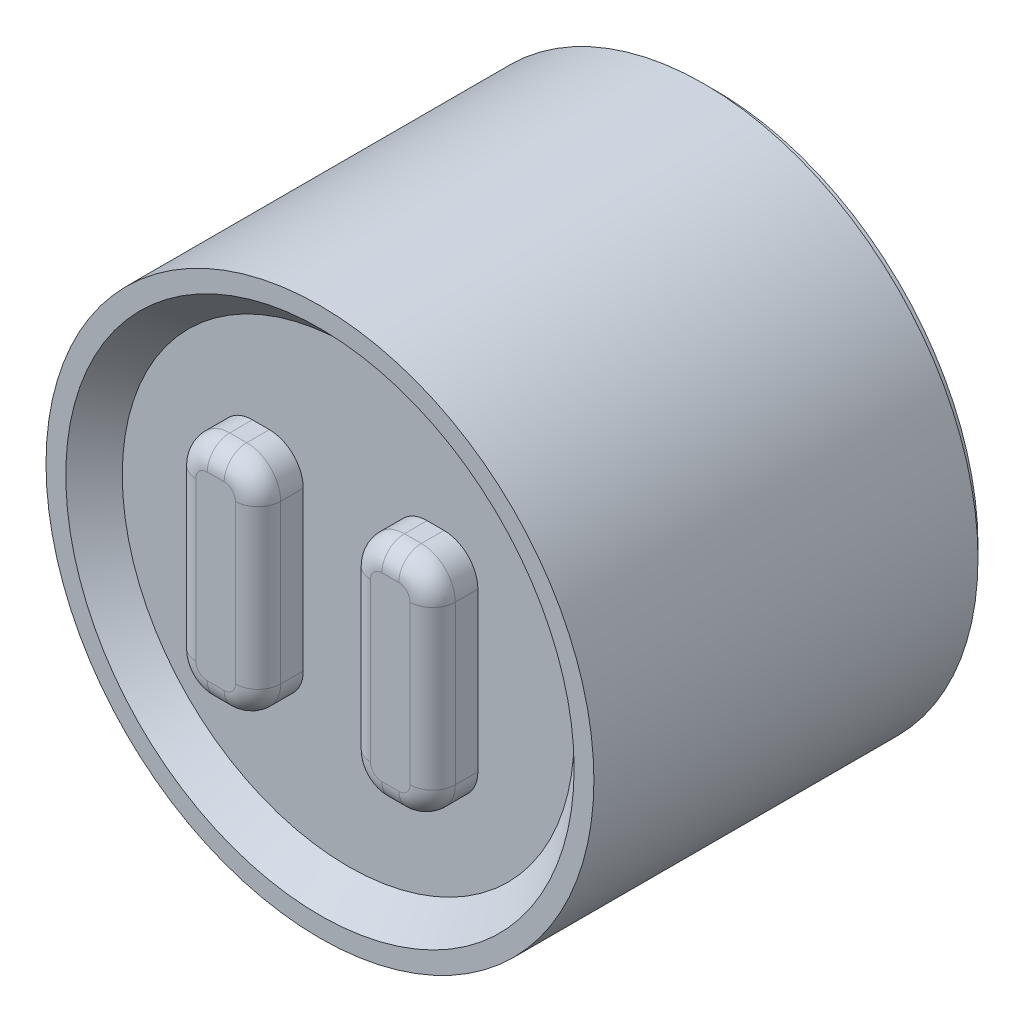
ISO-10303-21;
HEADER;
FILE_DESCRIPTION(('STEP AP214'),'2;1');
FILE_NAME('part.step','',(''),(''),'','','');
FILE_SCHEMA(('AUTOMOTIVE_DESIGN { 1 0 10303 214 1 1 1 1 }'));
ENDSEC;
DATA;
#1=APPLICATION_CONTEXT('core data for automotive mechanical design processes');
#2=APPLICATION_PROTOCOL_DEFINITION('international standard','automotive_design',2000,#1);
#3=PRODUCT_CONTEXT('',#1,'mechanical');
#4=PRODUCT('Part','Part','',(#3));
#5=PRODUCT_RELATED_PRODUCT_CATEGORY('part','',(#4));
#6=PRODUCT_DEFINITION_FORMATION('','',#4);
#7=PRODUCT_DEFINITION_CONTEXT('part definition',#1,'design');
#8=PRODUCT_DEFINITION('design','',#6,#7);
#9=PRODUCT_DEFINITION_SHAPE('','',#8);
#10=(LENGTH_UNIT() NAMED_UNIT(*) SI_UNIT(.MILLI.,.METRE.));
#11=(NAMED_UNIT(*) PLANE_ANGLE_UNIT() SI_UNIT($,.RADIAN.));
#12=(NAMED_UNIT(*) SI_UNIT($,.STERADIAN.) SOLID_ANGLE_UNIT());
#13=UNCERTAINTY_MEASURE_WITH_UNIT(LENGTH_MEASURE(1.E-05),#10,'distance_accuracy_value','');
#14=(GEOMETRIC_REPRESENTATION_CONTEXT(3) GLOBAL_UNCERTAINTY_ASSIGNED_CONTEXT((#13)) GLOBAL_UNIT_ASSIGNED_CONTEXT((#10,
#11,#12)) REPRESENTATION_CONTEXT('',''));
#15=CARTESIAN_POINT('',(0.,0.,0.));
#16=DIRECTION('',(0.,0.,1.));
#17=DIRECTION('',(1.,0.,0.));
#18=AXIS2_PLACEMENT_3D('',#15,#16,#17);
#19=CARTESIAN_POINT('',(0.,0.,6.3));
#20=DIRECTION('',(0.,0.,1.));
#21=DIRECTION('',(1.,0.,0.));
#22=AXIS2_PLACEMENT_3D('',#19,#20,#21);
#23=PLANE('',#22);
#24=CARTESIAN_POINT('',(0.,0.,6.3));
#25=DIRECTION('',(0.,0.,1.));
#26=DIRECTION('',(1.,0.,0.));
#27=AXIS2_PLACEMENT_3D('',#24,#25,#26);
#28=CIRCLE('',#27,4.);
#29=CARTESIAN_POINT('',(4.,0.,6.3));
#30=VERTEX_POINT('',#29);
#31=EDGE_CURVE('E294',#30,#30,#28,.T.);
#32=ORIENTED_EDGE('',*,*,#31,.T.);
#33=EDGE_LOOP('',(#32));
#34=FACE_BOUND('',#33,.T.);
#35=DIRECTION('',(1.,0.,0.));
#36=VECTOR('',#35,1.);
#37=CARTESIAN_POINT('',(-1.69576329592916,-2.,6.3));
#38=LINE('',#37,#36);
#39=CARTESIAN_POINT('',(-1.69576329592916,-2.,6.3));
#40=VERTEX_POINT('',#39);
#41=CARTESIAN_POINT('',(-1.39576329592917,-2.,6.3));
#42=VERTEX_POINT('',#41);
#43=EDGE_CURVE('E257',#40,#42,#38,.T.);
#44=ORIENTED_EDGE('',*,*,#43,.F.);
#45=CARTESIAN_POINT('',(-1.69576329592916,-1.4,6.3));
#46=DIRECTION('',(0.,0.,1.));
#47=DIRECTION('',(1.,0.,0.));
#48=AXIS2_PLACEMENT_3D('',#45,#46,#47);
#49=CIRCLE('',#48,0.6);
#50=CARTESIAN_POINT('',(-2.29576329592916,-1.4,6.3));
#51=VERTEX_POINT('',#50);
#52=EDGE_CURVE('E209',#51,#40,#49,.T.);
#53=ORIENTED_EDGE('',*,*,#52,.F.);
#54=DIRECTION('',(0.,-1.,0.));
#55=VECTOR('',#54,1.);
#56=CARTESIAN_POINT('',(-2.29576329592916,1.4,6.3));
#57=LINE('',#56,#55);
#58=CARTESIAN_POINT('',(-2.29576329592916,1.4,6.3));
#59=VERTEX_POINT('',#58);
#60=EDGE_CURVE('E275',#59,#51,#57,.T.);
#61=ORIENTED_EDGE('',*,*,#60,.F.);
#62=CARTESIAN_POINT('',(-1.69576329592916,1.4,6.3));
#63=DIRECTION('',(0.,0.,1.));
#64=DIRECTION('',(1.,0.,0.));
#65=AXIS2_PLACEMENT_3D('',#62,#63,#64);
#66=CIRCLE('',#65,0.6);
#67=CARTESIAN_POINT('',(-1.69576329592916,2.,6.3));
#68=VERTEX_POINT('',#67);
#69=EDGE_CURVE('E272',#68,#59,#66,.T.);
#70=ORIENTED_EDGE('',*,*,#69,.F.);
#71=DIRECTION('',(-1.,0.,0.));
#72=VECTOR('',#71,1.);
#73=CARTESIAN_POINT('',(-1.69576329592916,2.,6.3));
#74=LINE('',#73,#72);
#75=CARTESIAN_POINT('',(-1.39576329592917,2.,6.3));
#76=VERTEX_POINT('',#75);
#77=EDGE_CURVE('E269',#76,#68,#74,.T.);
#78=ORIENTED_EDGE('',*,*,#77,.F.);
#79=CARTESIAN_POINT('',(-1.39576329592916,1.4,6.3));
#80=DIRECTION('',(0.,0.,1.));
#81=DIRECTION('',(-1.,0.,0.));
#82=AXIS2_PLACEMENT_3D('',#79,#80,#81);
#83=CIRCLE('',#82,0.6);
#84=CARTESIAN_POINT('',(-0.795763295929162,1.4,6.3));
#85=VERTEX_POINT('',#84);
#86=EDGE_CURVE('E266',#85,#76,#83,.T.);
#87=ORIENTED_EDGE('',*,*,#86,.F.);
#88=DIRECTION('',(0.,1.,0.));
#89=VECTOR('',#88,1.);
#90=CARTESIAN_POINT('',(-0.795763295929162,1.4,6.3));
#91=LINE('',#90,#89);
#92=CARTESIAN_POINT('',(-0.795763295929162,-1.4,6.3));
#93=VERTEX_POINT('',#92);
#94=EDGE_CURVE('E263',#93,#85,#91,.T.);
#95=ORIENTED_EDGE('',*,*,#94,.F.);
#96=CARTESIAN_POINT('',(-1.39576329592916,-1.4,6.3));
#97=DIRECTION('',(0.,0.,1.));
#98=DIRECTION('',(1.,0.,0.));
#99=AXIS2_PLACEMENT_3D('',#96,#97,#98);
#100=CIRCLE('',#99,0.6);
#101=EDGE_CURVE('E260',#42,#93,#100,.T.);
#102=ORIENTED_EDGE('',*,*,#101,.F.);
#103=EDGE_LOOP('',(#44,#53,#61,#70,#78,#87,#95,#102));
#104=FACE_BOUND('',#103,.T.);
#105=DIRECTION('',(-1.,0.,0.));
#106=VECTOR('',#105,1.);
#107=CARTESIAN_POINT('',(1.69576329592916,2.,6.3));
#108=LINE('',#107,#106);
#109=CARTESIAN_POINT('',(1.69576329592916,2.,6.3));
#110=VERTEX_POINT('',#109);
#111=CARTESIAN_POINT('',(1.39576329592917,2.,6.3));
#112=VERTEX_POINT('',#111);
#113=EDGE_CURVE('E203',#110,#112,#108,.T.);
#114=ORIENTED_EDGE('',*,*,#113,.F.);
#115=CARTESIAN_POINT('',(1.69576329592916,1.4,6.3));
#116=DIRECTION('',(0.,0.,1.));
#117=DIRECTION('',(-1.,0.,0.));
#118=AXIS2_PLACEMENT_3D('',#115,#116,#117);
#119=CIRCLE('',#118,0.6);
#120=CARTESIAN_POINT('',(2.29576329592916,1.4,6.3));
#121=VERTEX_POINT('',#120);
#122=EDGE_CURVE('E213',#121,#110,#119,.T.);
#123=ORIENTED_EDGE('',*,*,#122,.F.);
#124=DIRECTION('',(0.,1.,0.));
#125=VECTOR('',#124,1.);
#126=CARTESIAN_POINT('',(2.29576329592916,1.4,6.3));
#127=LINE('',#126,#125);
#128=CARTESIAN_POINT('',(2.29576329592916,-1.4,6.3));
#129=VERTEX_POINT('',#128);
#130=EDGE_CURVE('E241',#129,#121,#127,.T.);
#131=ORIENTED_EDGE('',*,*,#130,.F.);
#132=CARTESIAN_POINT('',(1.69576329592916,-1.4,6.3));
#133=DIRECTION('',(0.,0.,1.));
#134=DIRECTION('',(-1.,0.,0.));
#135=AXIS2_PLACEMENT_3D('',#132,#133,#134);
#136=CIRCLE('',#135,0.6);
#137=CARTESIAN_POINT('',(1.69576329592916,-2.,6.3));
#138=VERTEX_POINT('',#137);
#139=EDGE_CURVE('E238',#138,#129,#136,.T.);
#140=ORIENTED_EDGE('',*,*,#139,.F.);
#141=DIRECTION('',(1.,0.,0.));
#142=VECTOR('',#141,1.);
#143=CARTESIAN_POINT('',(1.69576329592916,-2.,6.3));
#144=LINE('',#143,#142);
#145=CARTESIAN_POINT('',(1.39576329592917,-2.,6.3));
#146=VERTEX_POINT('',#145);
#147=EDGE_CURVE('E235',#146,#138,#144,.T.);
#148=ORIENTED_EDGE('',*,*,#147,.F.);
#149=CARTESIAN_POINT('',(1.39576329592916,-1.4,6.3));
#150=DIRECTION('',(0.,0.,1.));
#151=DIRECTION('',(-1.,0.,0.));
#152=AXIS2_PLACEMENT_3D('',#149,#150,#151);
#153=CIRCLE('',#152,0.6);
#154=CARTESIAN_POINT('',(0.795763295929162,-1.4,6.3));
#155=VERTEX_POINT('',#154);
#156=EDGE_CURVE('E232',#155,#146,#153,.T.);
#157=ORIENTED_EDGE('',*,*,#156,.F.);
#158=DIRECTION('',(0.,-1.,0.));
#159=VECTOR('',#158,1.);
#160=CARTESIAN_POINT('',(0.795763295929162,1.4,6.3));
#161=LINE('',#160,#159);
#162=CARTESIAN_POINT('',(0.795763295929162,1.4,6.3));
#163=VERTEX_POINT('',#162);
#164=EDGE_CURVE('E226',#163,#155,#161,.T.);
#165=ORIENTED_EDGE('',*,*,#164,.F.);
#166=CARTESIAN_POINT('',(1.39576329592916,1.4,6.3));
#167=DIRECTION('',(0.,0.,1.));
#168=DIRECTION('',(1.,0.,0.));
#169=AXIS2_PLACEMENT_3D('',#166,#167,#168);
#170=CIRCLE('',#169,0.6);
#171=EDGE_CURVE('E224',#112,#163,#170,.T.);
#172=ORIENTED_EDGE('',*,*,#171,.F.);
#173=EDGE_LOOP('',(#114,#123,#131,#140,#148,#157,#165,#172));
#174=FACE_BOUND('',#173,.T.);
#175=ADVANCED_FACE('F36',(#34,#104,#174),#23,.T.);
#176=CARTESIAN_POINT('',(0.,0.,6.8));
#177=DIRECTION('',(0.,0.,-1.));
#178=DIRECTION('',(-1.,0.,0.));
#179=AXIS2_PLACEMENT_3D('',#176,#177,#178);
#180=CYLINDRICAL_SURFACE('',#179,4.85);
#181=CARTESIAN_POINT('',(0.,0.,6.8));
#182=DIRECTION('',(0.,0.,1.));
#183=DIRECTION('',(1.,0.,0.));
#184=AXIS2_PLACEMENT_3D('',#181,#182,#183);
#185=CIRCLE('',#184,4.85);
#186=CARTESIAN_POINT('',(4.85,0.,6.8));
#187=VERTEX_POINT('',#186);
#188=EDGE_CURVE('E298',#187,#187,#185,.T.);
#189=ORIENTED_EDGE('',*,*,#188,.F.);
#190=EDGE_LOOP('',(#189));
#191=FACE_BOUND('',#190,.T.);
#192=CARTESIAN_POINT('',(0.,0.,0.));
#193=DIRECTION('',(0.,0.,1.));
#194=DIRECTION('',(1.,0.,0.));
#195=AXIS2_PLACEMENT_3D('',#192,#193,#194);
#196=CIRCLE('',#195,4.85);
#197=CARTESIAN_POINT('',(4.85,0.,0.));
#198=VERTEX_POINT('',#197);
#199=EDGE_CURVE('E297',#198,#198,#196,.T.);
#200=ORIENTED_EDGE('',*,*,#199,.T.);
#201=EDGE_LOOP('',(#200));
#202=FACE_BOUND('',#201,.T.);
#203=ADVANCED_FACE('F489',(#191,#202),#180,.T.);
#204=CARTESIAN_POINT('',(0.,0.,6.8));
#205=DIRECTION('',(0.,0.,1.));
#206=DIRECTION('',(1.,0.,0.));
#207=AXIS2_PLACEMENT_3D('',#204,#205,#206);
#208=PLANE('',#207);
#209=CARTESIAN_POINT('',(0.,0.,6.8));
#210=DIRECTION('',(0.,0.,1.));
#211=DIRECTION('',(1.,0.,0.));
#212=AXIS2_PLACEMENT_3D('',#209,#210,#211);
#213=CIRCLE('',#212,4.50000000000001);
#214=CARTESIAN_POINT('',(4.50000000000001,0.,6.8));
#215=VERTEX_POINT('',#214);
#216=EDGE_CURVE('E301',#215,#215,#213,.F.);
#217=ORIENTED_EDGE('',*,*,#216,.T.);
#218=EDGE_LOOP('',(#217));
#219=FACE_BOUND('',#218,.T.);
#220=ORIENTED_EDGE('',*,*,#188,.T.);
#221=EDGE_LOOP('',(#220));
#222=FACE_BOUND('',#221,.T.);
#223=ADVANCED_FACE('F495',(#219,#222),#208,.T.);
#224=CARTESIAN_POINT('',(0.,0.,0.));
#225=DIRECTION('',(0.,0.,1.));
#226=DIRECTION('',(1.,0.,0.));
#227=AXIS2_PLACEMENT_3D('',#224,#225,#226);
#228=PLANE('',#227);
#229=CARTESIAN_POINT('',(0.,0.,0.));
#230=DIRECTION('',(0.,0.,1.));
#231=DIRECTION('',(1.,0.,0.));
#232=AXIS2_PLACEMENT_3D('',#229,#230,#231);
#233=CIRCLE('',#232,4.65);
#234=CARTESIAN_POINT('',(4.65,0.,0.));
#235=VERTEX_POINT('',#234);
#236=EDGE_CURVE('E11',#235,#235,#233,.F.);
#237=ORIENTED_EDGE('',*,*,#236,.F.);
#238=EDGE_LOOP('',(#237));
#239=FACE_BOUND('',#238,.T.);
#240=ORIENTED_EDGE('',*,*,#199,.F.);
#241=EDGE_LOOP('',(#240));
#242=FACE_BOUND('',#241,.T.);
#243=ADVANCED_FACE('F503',(#239,#242),#228,.F.);
#244=CARTESIAN_POINT('',(0.,0.,6.3));
#245=DIRECTION('',(0.,0.,1.));
#246=DIRECTION('',(1.,0.,0.));
#247=AXIS2_PLACEMENT_3D('',#244,#245,#246);
#248=CONICAL_SURFACE('',#247,4.,0.78539816339745);
#249=ORIENTED_EDGE('',*,*,#216,.F.);
#250=EDGE_LOOP('',(#249));
#251=FACE_BOUND('',#250,.T.);
#252=ORIENTED_EDGE('',*,*,#31,.F.);
#253=EDGE_LOOP('',(#252));
#254=FACE_BOUND('',#253,.T.);
#255=ADVANCED_FACE('F506',(#251,#254),#248,.F.);
#256=CARTESIAN_POINT('',(-1.69576329592916,-1.4,7.1));
#257=DIRECTION('',(0.,0.,-1.));
#258=DIRECTION('',(-1.,0.,0.));
#259=AXIS2_PLACEMENT_3D('',#256,#257,#258);
#260=CYLINDRICAL_SURFACE('',#259,0.6);
#261=DIRECTION('',(0.,0.,-1.));
#262=VECTOR('',#261,1.);
#263=CARTESIAN_POINT('',(-1.69576329592916,-2.,7.1));
#264=LINE('',#263,#262);
#265=CARTESIAN_POINT('',(-1.69576329592916,-2.,6.7));
#266=VERTEX_POINT('',#265);
#267=EDGE_CURVE('E292',#266,#40,#264,.T.);
#268=ORIENTED_EDGE('',*,*,#267,.F.);
#269=CARTESIAN_POINT('',(-1.69576329592916,-1.4,6.7));
#270=DIRECTION('',(0.,0.,1.));
#271=DIRECTION('',(1.,0.,0.));
#272=AXIS2_PLACEMENT_3D('',#269,#270,#271);
#273=CIRCLE('',#272,0.6);
#274=CARTESIAN_POINT('',(-2.29576329592916,-1.4,6.7));
#275=VERTEX_POINT('',#274);
#276=EDGE_CURVE('E361',#266,#275,#273,.F.);
#277=ORIENTED_EDGE('',*,*,#276,.T.);
#278=DIRECTION('',(0.,0.,-1.));
#279=VECTOR('',#278,1.);
#280=CARTESIAN_POINT('',(-2.29576329592916,-1.4,7.1));
#281=LINE('',#280,#279);
#282=EDGE_CURVE('E278',#275,#51,#281,.T.);
#283=ORIENTED_EDGE('',*,*,#282,.T.);
#284=ORIENTED_EDGE('',*,*,#52,.T.);
#285=EDGE_LOOP('',(#268,#277,#283,#284));
#286=FACE_BOUND('',#285,.T.);
#287=ADVANCED_FACE('F435',(#286),#260,.T.);
#288=CARTESIAN_POINT('',(-1.69576329592916,-2.,7.1));
#289=DIRECTION('',(0.,1.,0.));
#290=DIRECTION('',(0.,0.,1.));
#291=AXIS2_PLACEMENT_3D('',#288,#289,#290);
#292=PLANE('',#291);
#293=DIRECTION('',(0.,0.,-1.));
#294=VECTOR('',#293,1.);
#295=CARTESIAN_POINT('',(-1.39576329592917,-2.,7.1));
#296=LINE('',#295,#294);
#297=CARTESIAN_POINT('',(-1.39576329592917,-2.,6.7));
#298=VERTEX_POINT('',#297);
#299=EDGE_CURVE('E290',#298,#42,#296,.T.);
#300=ORIENTED_EDGE('',*,*,#299,.F.);
#301=DIRECTION('',(1.,0.,0.));
#302=VECTOR('',#301,1.);
#303=CARTESIAN_POINT('',(-1.69576329592916,-2.,6.7));
#304=LINE('',#303,#302);
#305=EDGE_CURVE('E359',#298,#266,#304,.F.);
#306=ORIENTED_EDGE('',*,*,#305,.T.);
#307=ORIENTED_EDGE('',*,*,#267,.T.);
#308=ORIENTED_EDGE('',*,*,#43,.T.);
#309=EDGE_LOOP('',(#300,#306,#307,#308));
#310=FACE_BOUND('',#309,.T.);
#311=ADVANCED_FACE('F438',(#310),#292,.F.);
#312=CARTESIAN_POINT('',(-1.39576329592916,-1.4,7.1));
#313=DIRECTION('',(0.,0.,-1.));
#314=DIRECTION('',(-1.,0.,0.));
#315=AXIS2_PLACEMENT_3D('',#312,#313,#314);
#316=CYLINDRICAL_SURFACE('',#315,0.6);
#317=DIRECTION('',(0.,0.,-1.));
#318=VECTOR('',#317,1.);
#319=CARTESIAN_POINT('',(-0.795763295929162,-1.4,7.1));
#320=LINE('',#319,#318);
#321=CARTESIAN_POINT('',(-0.795763295929162,-1.4,6.7));
#322=VERTEX_POINT('',#321);
#323=EDGE_CURVE('E288',#322,#93,#320,.T.);
#324=ORIENTED_EDGE('',*,*,#323,.F.);
#325=CARTESIAN_POINT('',(-1.39576329592916,-1.4,6.7));
#326=DIRECTION('',(0.,0.,1.));
#327=DIRECTION('',(1.,0.,0.));
#328=AXIS2_PLACEMENT_3D('',#325,#326,#327);
#329=CIRCLE('',#328,0.6);
#330=EDGE_CURVE('E357',#322,#298,#329,.F.);
#331=ORIENTED_EDGE('',*,*,#330,.T.);
#332=ORIENTED_EDGE('',*,*,#299,.T.);
#333=ORIENTED_EDGE('',*,*,#101,.T.);
#334=EDGE_LOOP('',(#324,#331,#332,#333));
#335=FACE_BOUND('',#334,.T.);
#336=ADVANCED_FACE('F621',(#335),#316,.T.);
#337=CARTESIAN_POINT('',(-0.795763295929162,1.4,7.1));
#338=DIRECTION('',(-1.,0.,0.));
#339=DIRECTION('',(0.,-1.,0.));
#340=AXIS2_PLACEMENT_3D('',#337,#338,#339);
#341=PLANE('',#340);
#342=DIRECTION('',(0.,0.,-1.));
#343=VECTOR('',#342,1.);
#344=CARTESIAN_POINT('',(-0.795763295929162,1.4,7.1));
#345=LINE('',#344,#343);
#346=CARTESIAN_POINT('',(-0.795763295929162,1.4,6.7));
#347=VERTEX_POINT('',#346);
#348=EDGE_CURVE('E286',#347,#85,#345,.T.);
#349=ORIENTED_EDGE('',*,*,#348,.F.);
#350=DIRECTION('',(0.,1.,0.));
#351=VECTOR('',#350,1.);
#352=CARTESIAN_POINT('',(-0.795763295929162,-1.4,6.7));
#353=LINE('',#352,#351);
#354=EDGE_CURVE('E354',#347,#322,#353,.F.);
#355=ORIENTED_EDGE('',*,*,#354,.T.);
#356=ORIENTED_EDGE('',*,*,#323,.T.);
#357=ORIENTED_EDGE('',*,*,#94,.T.);
#358=EDGE_LOOP('',(#349,#355,#356,#357));
#359=FACE_BOUND('',#358,.T.);
#360=ADVANCED_FACE('F470',(#359),#341,.F.);
#361=CARTESIAN_POINT('',(-1.39576329592916,1.4,7.1));
#362=DIRECTION('',(0.,0.,-1.));
#363=DIRECTION('',(-1.,0.,0.));
#364=AXIS2_PLACEMENT_3D('',#361,#362,#363);
#365=CYLINDRICAL_SURFACE('',#364,0.6);
#366=DIRECTION('',(0.,0.,-1.));
#367=VECTOR('',#366,1.);
#368=CARTESIAN_POINT('',(-1.39576329592917,2.,7.1));
#369=LINE('',#368,#367);
#370=CARTESIAN_POINT('',(-1.39576329592917,2.,6.7));
#371=VERTEX_POINT('',#370);
#372=EDGE_CURVE('E284',#371,#76,#369,.T.);
#373=ORIENTED_EDGE('',*,*,#372,.F.);
#374=CARTESIAN_POINT('',(-1.39576329592916,1.4,6.7));
#375=DIRECTION('',(0.,0.,1.));
#376=DIRECTION('',(1.,0.,0.));
#377=AXIS2_PLACEMENT_3D('',#374,#375,#376);
#378=CIRCLE('',#377,0.6);
#379=EDGE_CURVE('E44',#371,#347,#378,.F.);
#380=ORIENTED_EDGE('',*,*,#379,.T.);
#381=ORIENTED_EDGE('',*,*,#348,.T.);
#382=ORIENTED_EDGE('',*,*,#86,.T.);
#383=EDGE_LOOP('',(#373,#380,#381,#382));
#384=FACE_BOUND('',#383,.T.);
#385=ADVANCED_FACE('F467',(#384),#365,.T.);
#386=CARTESIAN_POINT('',(-1.69576329592916,2.,7.1));
#387=DIRECTION('',(0.,-1.,0.));
#388=DIRECTION('',(0.,0.,-1.));
#389=AXIS2_PLACEMENT_3D('',#386,#387,#388);
#390=PLANE('',#389);
#391=DIRECTION('',(0.,0.,-1.));
#392=VECTOR('',#391,1.);
#393=CARTESIAN_POINT('',(-1.69576329592916,2.,7.1));
#394=LINE('',#393,#392);
#395=CARTESIAN_POINT('',(-1.69576329592916,2.,6.7));
#396=VERTEX_POINT('',#395);
#397=EDGE_CURVE('E282',#396,#68,#394,.T.);
#398=ORIENTED_EDGE('',*,*,#397,.F.);
#399=DIRECTION('',(-1.,0.,0.));
#400=VECTOR('',#399,1.);
#401=CARTESIAN_POINT('',(-1.39576329592917,2.,6.7));
#402=LINE('',#401,#400);
#403=EDGE_CURVE('E51',#396,#371,#402,.F.);
#404=ORIENTED_EDGE('',*,*,#403,.T.);
#405=ORIENTED_EDGE('',*,*,#372,.T.);
#406=ORIENTED_EDGE('',*,*,#77,.T.);
#407=EDGE_LOOP('',(#398,#404,#405,#406));
#408=FACE_BOUND('',#407,.T.);
#409=ADVANCED_FACE('F614',(#408),#390,.F.);
#410=CARTESIAN_POINT('',(-1.69576329592916,1.4,7.1));
#411=DIRECTION('',(0.,0.,-1.));
#412=DIRECTION('',(-1.,0.,0.));
#413=AXIS2_PLACEMENT_3D('',#410,#411,#412);
#414=CYLINDRICAL_SURFACE('',#413,0.6);
#415=DIRECTION('',(0.,0.,-1.));
#416=VECTOR('',#415,1.);
#417=CARTESIAN_POINT('',(-2.29576329592916,1.4,7.1));
#418=LINE('',#417,#416);
#419=CARTESIAN_POINT('',(-2.29576329592916,1.4,6.7));
#420=VERTEX_POINT('',#419);
#421=EDGE_CURVE('E280',#420,#59,#418,.T.);
#422=ORIENTED_EDGE('',*,*,#421,.F.);
#423=CARTESIAN_POINT('',(-1.69576329592916,1.4,6.7));
#424=DIRECTION('',(0.,0.,1.));
#425=DIRECTION('',(1.,0.,0.));
#426=AXIS2_PLACEMENT_3D('',#423,#424,#425);
#427=CIRCLE('',#426,0.6);
#428=EDGE_CURVE('E59',#420,#396,#427,.F.);
#429=ORIENTED_EDGE('',*,*,#428,.T.);
#430=ORIENTED_EDGE('',*,*,#397,.T.);
#431=ORIENTED_EDGE('',*,*,#69,.T.);
#432=EDGE_LOOP('',(#422,#429,#430,#431));
#433=FACE_BOUND('',#432,.T.);
#434=ADVANCED_FACE('F425',(#433),#414,.T.);
#435=CARTESIAN_POINT('',(-2.29576329592916,1.4,7.1));
#436=DIRECTION('',(1.,0.,0.));
#437=DIRECTION('',(0.,0.,-1.));
#438=AXIS2_PLACEMENT_3D('',#435,#436,#437);
#439=PLANE('',#438);
#440=ORIENTED_EDGE('',*,*,#282,.F.);
#441=DIRECTION('',(0.,-1.,0.));
#442=VECTOR('',#441,1.);
#443=CARTESIAN_POINT('',(-2.29576329592916,1.4,6.7));
#444=LINE('',#443,#442);
#445=EDGE_CURVE('E363',#275,#420,#444,.F.);
#446=ORIENTED_EDGE('',*,*,#445,.T.);
#447=ORIENTED_EDGE('',*,*,#421,.T.);
#448=ORIENTED_EDGE('',*,*,#60,.T.);
#449=EDGE_LOOP('',(#440,#446,#447,#448));
#450=FACE_BOUND('',#449,.T.);
#451=ADVANCED_FACE('F424',(#450),#439,.F.);
#452=CARTESIAN_POINT('',(-1.69576329592916,-1.4,7.1));
#453=DIRECTION('',(0.,0.,1.));
#454=DIRECTION('',(1.,0.,0.));
#455=AXIS2_PLACEMENT_3D('',#452,#453,#454);
#456=PLANE('',#455);
#457=CARTESIAN_POINT('',(-1.39576329592916,-1.4,7.1));
#458=DIRECTION('',(0.,0.,1.));
#459=DIRECTION('',(1.,0.,0.));
#460=AXIS2_PLACEMENT_3D('',#457,#458,#459);
#461=CIRCLE('',#460,0.2);
#462=CARTESIAN_POINT('',(-1.39576329592916,-1.6,7.1));
#463=VERTEX_POINT('',#462);
#464=CARTESIAN_POINT('',(-1.19576329592916,-1.4,7.1));
#465=VERTEX_POINT('',#464);
#466=EDGE_CURVE('E349',#463,#465,#461,.T.);
#467=ORIENTED_EDGE('',*,*,#466,.T.);
#468=DIRECTION('',(0.,1.,0.));
#469=VECTOR('',#468,1.);
#470=CARTESIAN_POINT('',(-1.19576329592916,1.4,7.1));
#471=LINE('',#470,#469);
#472=CARTESIAN_POINT('',(-1.19576329592916,1.4,7.1));
#473=VERTEX_POINT('',#472);
#474=EDGE_CURVE('E351',#465,#473,#471,.T.);
#475=ORIENTED_EDGE('',*,*,#474,.T.);
#476=CARTESIAN_POINT('',(-1.39576329592916,1.4,7.1));
#477=DIRECTION('',(0.,0.,1.));
#478=DIRECTION('',(1.,0.,0.));
#479=AXIS2_PLACEMENT_3D('',#476,#477,#478);
#480=CIRCLE('',#479,0.2);
#481=CARTESIAN_POINT('',(-1.39576329592917,1.6,7.1));
#482=VERTEX_POINT('',#481);
#483=EDGE_CURVE('E337',#473,#482,#480,.T.);
#484=ORIENTED_EDGE('',*,*,#483,.T.);
#485=DIRECTION('',(-1.,0.,0.));
#486=VECTOR('',#485,1.);
#487=CARTESIAN_POINT('',(-1.69576329592916,1.6,7.1));
#488=LINE('',#487,#486);
#489=CARTESIAN_POINT('',(-1.69576329592916,1.6,7.1));
#490=VERTEX_POINT('',#489);
#491=EDGE_CURVE('E339',#482,#490,#488,.T.);
#492=ORIENTED_EDGE('',*,*,#491,.T.);
#493=CARTESIAN_POINT('',(-1.69576329592916,1.4,7.1));
#494=DIRECTION('',(0.,0.,1.));
#495=DIRECTION('',(1.,0.,0.));
#496=AXIS2_PLACEMENT_3D('',#493,#494,#495);
#497=CIRCLE('',#496,0.2);
#498=CARTESIAN_POINT('',(-1.89576329592916,1.4,7.1));
#499=VERTEX_POINT('',#498);
#500=EDGE_CURVE('E341',#490,#499,#497,.T.);
#501=ORIENTED_EDGE('',*,*,#500,.T.);
#502=DIRECTION('',(0.,-1.,0.));
#503=VECTOR('',#502,1.);
#504=CARTESIAN_POINT('',(-1.89576329592916,-1.4,7.1));
#505=LINE('',#504,#503);
#506=CARTESIAN_POINT('',(-1.89576329592916,-1.4,7.1));
#507=VERTEX_POINT('',#506);
#508=EDGE_CURVE('E343',#499,#507,#505,.T.);
#509=ORIENTED_EDGE('',*,*,#508,.T.);
#510=CARTESIAN_POINT('',(-1.69576329592916,-1.4,7.1));
#511=DIRECTION('',(0.,0.,1.));
#512=DIRECTION('',(1.,0.,0.));
#513=AXIS2_PLACEMENT_3D('',#510,#511,#512);
#514=CIRCLE('',#513,0.2);
#515=CARTESIAN_POINT('',(-1.69576329592916,-1.6,7.1));
#516=VERTEX_POINT('',#515);
#517=EDGE_CURVE('E345',#507,#516,#514,.T.);
#518=ORIENTED_EDGE('',*,*,#517,.T.);
#519=DIRECTION('',(1.,0.,0.));
#520=VECTOR('',#519,1.);
#521=CARTESIAN_POINT('',(-1.39576329592917,-1.6,7.1));
#522=LINE('',#521,#520);
#523=EDGE_CURVE('E347',#516,#463,#522,.T.);
#524=ORIENTED_EDGE('',*,*,#523,.T.);
#525=EDGE_LOOP('',(#467,#475,#484,#492,#501,#509,#518,#524));
#526=FACE_BOUND('',#525,.T.);
#527=ADVANCED_FACE('F451',(#526),#456,.T.);
#528=CARTESIAN_POINT('',(1.69576329592916,1.4,7.1));
#529=DIRECTION('',(0.,0.,-1.));
#530=DIRECTION('',(-1.,0.,0.));
#531=AXIS2_PLACEMENT_3D('',#528,#529,#530);
#532=CYLINDRICAL_SURFACE('',#531,0.6);
#533=DIRECTION('',(0.,0.,-1.));
#534=VECTOR('',#533,1.);
#535=CARTESIAN_POINT('',(1.69576329592916,2.,7.1));
#536=LINE('',#535,#534);
#537=CARTESIAN_POINT('',(1.69576329592916,2.,6.7));
#538=VERTEX_POINT('',#537);
#539=EDGE_CURVE('E198',#538,#110,#536,.T.);
#540=ORIENTED_EDGE('',*,*,#539,.F.);
#541=CARTESIAN_POINT('',(1.69576329592916,1.4,6.7));
#542=DIRECTION('',(0.,0.,-1.));
#543=DIRECTION('',(-1.,0.,0.));
#544=AXIS2_PLACEMENT_3D('',#541,#542,#543);
#545=CIRCLE('',#544,0.6);
#546=CARTESIAN_POINT('',(2.29576329592916,1.4,6.7));
#547=VERTEX_POINT('',#546);
#548=EDGE_CURVE('E367',#538,#547,#545,.T.);
#549=ORIENTED_EDGE('',*,*,#548,.T.);
#550=DIRECTION('',(0.,0.,-1.));
#551=VECTOR('',#550,1.);
#552=CARTESIAN_POINT('',(2.29576329592916,1.4,7.1));
#553=LINE('',#552,#551);
#554=EDGE_CURVE('E216',#547,#121,#553,.T.);
#555=ORIENTED_EDGE('',*,*,#554,.T.);
#556=ORIENTED_EDGE('',*,*,#122,.T.);
#557=EDGE_LOOP('',(#540,#549,#555,#556));
#558=FACE_BOUND('',#557,.T.);
#559=ADVANCED_FACE('F214',(#558),#532,.T.);
#560=CARTESIAN_POINT('',(1.69576329592916,2.,7.1));
#561=DIRECTION('',(0.,-1.,0.));
#562=DIRECTION('',(0.,0.,-1.));
#563=AXIS2_PLACEMENT_3D('',#560,#561,#562);
#564=PLANE('',#563);
#565=DIRECTION('',(0.,0.,-1.));
#566=VECTOR('',#565,1.);
#567=CARTESIAN_POINT('',(1.39576329592917,2.,7.1));
#568=LINE('',#567,#566);
#569=CARTESIAN_POINT('',(1.39576329592917,2.,6.7));
#570=VERTEX_POINT('',#569);
#571=EDGE_CURVE('E210',#570,#112,#568,.T.);
#572=ORIENTED_EDGE('',*,*,#571,.F.);
#573=DIRECTION('',(-1.,0.,0.));
#574=VECTOR('',#573,1.);
#575=CARTESIAN_POINT('',(1.69576329592916,2.,6.7));
#576=LINE('',#575,#574);
#577=EDGE_CURVE('E206',#570,#538,#576,.F.);
#578=ORIENTED_EDGE('',*,*,#577,.T.);
#579=ORIENTED_EDGE('',*,*,#539,.T.);
#580=ORIENTED_EDGE('',*,*,#113,.T.);
#581=EDGE_LOOP('',(#572,#578,#579,#580));
#582=FACE_BOUND('',#581,.T.);
#583=ADVANCED_FACE('F201',(#582),#564,.F.);
#584=CARTESIAN_POINT('',(1.39576329592916,1.4,7.1));
#585=DIRECTION('',(0.,0.,-1.));
#586=DIRECTION('',(-1.,0.,0.));
#587=AXIS2_PLACEMENT_3D('',#584,#585,#586);
#588=CYLINDRICAL_SURFACE('',#587,0.6);
#589=DIRECTION('',(0.,0.,-1.));
#590=VECTOR('',#589,1.);
#591=CARTESIAN_POINT('',(0.795763295929162,1.4,7.1));
#592=LINE('',#591,#590);
#593=CARTESIAN_POINT('',(0.795763295929162,1.4,6.7));
#594=VERTEX_POINT('',#593);
#595=EDGE_CURVE('E252',#594,#163,#592,.T.);
#596=ORIENTED_EDGE('',*,*,#595,.F.);
#597=CARTESIAN_POINT('',(1.39576329592916,1.4,6.7));
#598=DIRECTION('',(0.,0.,-1.));
#599=DIRECTION('',(-1.,0.,0.));
#600=AXIS2_PLACEMENT_3D('',#597,#598,#599);
#601=CIRCLE('',#600,0.6);
#602=EDGE_CURVE('E334',#594,#570,#601,.T.);
#603=ORIENTED_EDGE('',*,*,#602,.T.);
#604=ORIENTED_EDGE('',*,*,#571,.T.);
#605=ORIENTED_EDGE('',*,*,#171,.T.);
#606=EDGE_LOOP('',(#596,#603,#604,#605));
#607=FACE_BOUND('',#606,.T.);
#608=ADVANCED_FACE('F558',(#607),#588,.T.);
#609=CARTESIAN_POINT('',(0.795763295929162,1.4,7.1));
#610=DIRECTION('',(1.,0.,0.));
#611=DIRECTION('',(0.,1.,0.));
#612=AXIS2_PLACEMENT_3D('',#609,#610,#611);
#613=PLANE('',#612);
#614=DIRECTION('',(0.,0.,-1.));
#615=VECTOR('',#614,1.);
#616=CARTESIAN_POINT('',(0.795763295929162,-1.4,7.1));
#617=LINE('',#616,#615);
#618=CARTESIAN_POINT('',(0.795763295929162,-1.4,6.7));
#619=VERTEX_POINT('',#618);
#620=EDGE_CURVE('E250',#619,#155,#617,.T.);
#621=ORIENTED_EDGE('',*,*,#620,.F.);
#622=DIRECTION('',(0.,-1.,0.));
#623=VECTOR('',#622,1.);
#624=CARTESIAN_POINT('',(0.795763295929162,1.4,6.7));
#625=LINE('',#624,#623);
#626=EDGE_CURVE('E332',#619,#594,#625,.F.);
#627=ORIENTED_EDGE('',*,*,#626,.T.);
#628=ORIENTED_EDGE('',*,*,#595,.T.);
#629=ORIENTED_EDGE('',*,*,#164,.T.);
#630=EDGE_LOOP('',(#621,#627,#628,#629));
#631=FACE_BOUND('',#630,.T.);
#632=ADVANCED_FACE('F561',(#631),#613,.F.);
#633=CARTESIAN_POINT('',(1.39576329592916,-1.4,7.1));
#634=DIRECTION('',(0.,0.,-1.));
#635=DIRECTION('',(-1.,0.,0.));
#636=AXIS2_PLACEMENT_3D('',#633,#634,#635);
#637=CYLINDRICAL_SURFACE('',#636,0.6);
#638=DIRECTION('',(0.,0.,-1.));
#639=VECTOR('',#638,1.);
#640=CARTESIAN_POINT('',(1.39576329592917,-2.,7.1));
#641=LINE('',#640,#639);
#642=CARTESIAN_POINT('',(1.39576329592917,-2.,6.7));
#643=VERTEX_POINT('',#642);
#644=EDGE_CURVE('E248',#643,#146,#641,.T.);
#645=ORIENTED_EDGE('',*,*,#644,.F.);
#646=CARTESIAN_POINT('',(1.39576329592916,-1.4,6.7));
#647=DIRECTION('',(0.,0.,-1.));
#648=DIRECTION('',(-1.,0.,0.));
#649=AXIS2_PLACEMENT_3D('',#646,#647,#648);
#650=CIRCLE('',#649,0.6);
#651=EDGE_CURVE('E330',#643,#619,#650,.T.);
#652=ORIENTED_EDGE('',*,*,#651,.T.);
#653=ORIENTED_EDGE('',*,*,#620,.T.);
#654=ORIENTED_EDGE('',*,*,#156,.T.);
#655=EDGE_LOOP('',(#645,#652,#653,#654));
#656=FACE_BOUND('',#655,.T.);
#657=ADVANCED_FACE('F565',(#656),#637,.T.);
#658=CARTESIAN_POINT('',(1.69576329592916,-2.,7.1));
#659=DIRECTION('',(0.,1.,0.));
#660=DIRECTION('',(0.,0.,1.));
#661=AXIS2_PLACEMENT_3D('',#658,#659,#660);
#662=PLANE('',#661);
#663=DIRECTION('',(0.,0.,-1.));
#664=VECTOR('',#663,1.);
#665=CARTESIAN_POINT('',(1.69576329592916,-2.,7.1));
#666=LINE('',#665,#664);
#667=CARTESIAN_POINT('',(1.69576329592916,-2.,6.7));
#668=VERTEX_POINT('',#667);
#669=EDGE_CURVE('E246',#668,#138,#666,.T.);
#670=ORIENTED_EDGE('',*,*,#669,.F.);
#671=DIRECTION('',(1.,0.,0.));
#672=VECTOR('',#671,1.);
#673=CARTESIAN_POINT('',(1.69576329592916,-2.,6.7));
#674=LINE('',#673,#672);
#675=EDGE_CURVE('E328',#668,#643,#674,.F.);
#676=ORIENTED_EDGE('',*,*,#675,.T.);
#677=ORIENTED_EDGE('',*,*,#644,.T.);
#678=ORIENTED_EDGE('',*,*,#147,.T.);
#679=EDGE_LOOP('',(#670,#676,#677,#678));
#680=FACE_BOUND('',#679,.T.);
#681=ADVANCED_FACE('F588',(#680),#662,.F.);
#682=CARTESIAN_POINT('',(1.69576329592916,-1.4,7.1));
#683=DIRECTION('',(0.,0.,-1.));
#684=DIRECTION('',(-1.,0.,0.));
#685=AXIS2_PLACEMENT_3D('',#682,#683,#684);
#686=CYLINDRICAL_SURFACE('',#685,0.6);
#687=DIRECTION('',(0.,0.,-1.));
#688=VECTOR('',#687,1.);
#689=CARTESIAN_POINT('',(2.29576329592916,-1.4,7.1));
#690=LINE('',#689,#688);
#691=CARTESIAN_POINT('',(2.29576329592916,-1.4,6.7));
#692=VERTEX_POINT('',#691);
#693=EDGE_CURVE('E244',#692,#129,#690,.T.);
#694=ORIENTED_EDGE('',*,*,#693,.F.);
#695=CARTESIAN_POINT('',(1.69576329592916,-1.4,6.7));
#696=DIRECTION('',(0.,0.,-1.));
#697=DIRECTION('',(-1.,0.,0.));
#698=AXIS2_PLACEMENT_3D('',#695,#696,#697);
#699=CIRCLE('',#698,0.6);
#700=EDGE_CURVE('E326',#692,#668,#699,.T.);
#701=ORIENTED_EDGE('',*,*,#700,.T.);
#702=ORIENTED_EDGE('',*,*,#669,.T.);
#703=ORIENTED_EDGE('',*,*,#139,.T.);
#704=EDGE_LOOP('',(#694,#701,#702,#703));
#705=FACE_BOUND('',#704,.T.);
#706=ADVANCED_FACE('F586',(#705),#686,.T.);
#707=CARTESIAN_POINT('',(2.29576329592916,1.4,7.1));
#708=DIRECTION('',(-1.,0.,0.));
#709=DIRECTION('',(0.,0.,1.));
#710=AXIS2_PLACEMENT_3D('',#707,#708,#709);
#711=PLANE('',#710);
#712=ORIENTED_EDGE('',*,*,#554,.F.);
#713=DIRECTION('',(0.,1.,0.));
#714=VECTOR('',#713,1.);
#715=CARTESIAN_POINT('',(2.29576329592916,1.4,6.7));
#716=LINE('',#715,#714);
#717=EDGE_CURVE('E323',#547,#692,#716,.F.);
#718=ORIENTED_EDGE('',*,*,#717,.T.);
#719=ORIENTED_EDGE('',*,*,#693,.T.);
#720=ORIENTED_EDGE('',*,*,#130,.T.);
#721=EDGE_LOOP('',(#712,#718,#719,#720));
#722=FACE_BOUND('',#721,.T.);
#723=ADVANCED_FACE('F546',(#722),#711,.F.);
#724=CARTESIAN_POINT('',(1.69576329592916,1.4,7.1));
#725=DIRECTION('',(0.,0.,-1.));
#726=DIRECTION('',(-1.,0.,0.));
#727=AXIS2_PLACEMENT_3D('',#724,#725,#726);
#728=PLANE('',#727);
#729=CARTESIAN_POINT('',(1.69576329592916,-1.4,7.1));
#730=DIRECTION('',(0.,0.,-1.));
#731=DIRECTION('',(-1.,0.,0.));
#732=AXIS2_PLACEMENT_3D('',#729,#730,#731);
#733=CIRCLE('',#732,0.2);
#734=CARTESIAN_POINT('',(1.69576329592916,-1.6,7.1));
#735=VERTEX_POINT('',#734);
#736=CARTESIAN_POINT('',(1.89576329592916,-1.4,7.1));
#737=VERTEX_POINT('',#736);
#738=EDGE_CURVE('E318',#735,#737,#733,.F.);
#739=ORIENTED_EDGE('',*,*,#738,.T.);
#740=DIRECTION('',(0.,1.,0.));
#741=VECTOR('',#740,1.);
#742=CARTESIAN_POINT('',(1.89576329592916,1.4,7.1));
#743=LINE('',#742,#741);
#744=CARTESIAN_POINT('',(1.89576329592916,1.4,7.1));
#745=VERTEX_POINT('',#744);
#746=EDGE_CURVE('E320',#737,#745,#743,.T.);
#747=ORIENTED_EDGE('',*,*,#746,.T.);
#748=CARTESIAN_POINT('',(1.69576329592916,1.4,7.1));
#749=DIRECTION('',(0.,0.,-1.));
#750=DIRECTION('',(-1.,0.,0.));
#751=AXIS2_PLACEMENT_3D('',#748,#749,#750);
#752=CIRCLE('',#751,0.2);
#753=CARTESIAN_POINT('',(1.69576329592916,1.6,7.1));
#754=VERTEX_POINT('',#753);
#755=EDGE_CURVE('E306',#745,#754,#752,.F.);
#756=ORIENTED_EDGE('',*,*,#755,.T.);
#757=DIRECTION('',(-1.,0.,0.));
#758=VECTOR('',#757,1.);
#759=CARTESIAN_POINT('',(1.69576329592916,1.6,7.1));
#760=LINE('',#759,#758);
#761=CARTESIAN_POINT('',(1.39576329592916,1.6,7.1));
#762=VERTEX_POINT('',#761);
#763=EDGE_CURVE('E308',#754,#762,#760,.T.);
#764=ORIENTED_EDGE('',*,*,#763,.T.);
#765=CARTESIAN_POINT('',(1.39576329592916,1.4,7.1));
#766=DIRECTION('',(0.,0.,-1.));
#767=DIRECTION('',(-1.,0.,0.));
#768=AXIS2_PLACEMENT_3D('',#765,#766,#767);
#769=CIRCLE('',#768,0.2);
#770=CARTESIAN_POINT('',(1.19576329592916,1.4,7.1));
#771=VERTEX_POINT('',#770);
#772=EDGE_CURVE('E310',#762,#771,#769,.F.);
#773=ORIENTED_EDGE('',*,*,#772,.T.);
#774=DIRECTION('',(0.,-1.,0.));
#775=VECTOR('',#774,1.);
#776=CARTESIAN_POINT('',(1.19576329592916,1.4,7.1));
#777=LINE('',#776,#775);
#778=CARTESIAN_POINT('',(1.19576329592916,-1.4,7.1));
#779=VERTEX_POINT('',#778);
#780=EDGE_CURVE('E312',#771,#779,#777,.T.);
#781=ORIENTED_EDGE('',*,*,#780,.T.);
#782=CARTESIAN_POINT('',(1.39576329592916,-1.4,7.1));
#783=DIRECTION('',(0.,0.,-1.));
#784=DIRECTION('',(-1.,0.,0.));
#785=AXIS2_PLACEMENT_3D('',#782,#783,#784);
#786=CIRCLE('',#785,0.2);
#787=CARTESIAN_POINT('',(1.39576329592917,-1.6,7.1));
#788=VERTEX_POINT('',#787);
#789=EDGE_CURVE('E314',#779,#788,#786,.F.);
#790=ORIENTED_EDGE('',*,*,#789,.T.);
#791=DIRECTION('',(1.,0.,0.));
#792=VECTOR('',#791,1.);
#793=CARTESIAN_POINT('',(1.69576329592916,-1.6,7.1));
#794=LINE('',#793,#792);
#795=EDGE_CURVE('E316',#788,#735,#794,.T.);
#796=ORIENTED_EDGE('',*,*,#795,.T.);
#797=EDGE_LOOP('',(#739,#747,#756,#764,#773,#781,#790,#796));
#798=FACE_BOUND('',#797,.T.);
#799=ADVANCED_FACE('F541',(#798),#728,.F.);
#800=CARTESIAN_POINT('',(1.19576329592916,1.4,6.7));
#801=DIRECTION('',(0.,-1.,0.));
#802=DIRECTION('',(1.,0.,0.));
#803=AXIS2_PLACEMENT_3D('',#800,#801,#802);
#804=CYLINDRICAL_SURFACE('',#803,0.4);
#805=CARTESIAN_POINT('',(1.19576329592916,1.4,6.7));
#806=DIRECTION('',(0.,1.,0.));
#807=DIRECTION('',(0.,0.,1.));
#808=AXIS2_PLACEMENT_3D('',#805,#806,#807);
#809=CIRCLE('',#808,0.4);
#810=EDGE_CURVE('E387',#594,#771,#809,.T.);
#811=ORIENTED_EDGE('',*,*,#810,.F.);
#812=ORIENTED_EDGE('',*,*,#626,.F.);
#813=CARTESIAN_POINT('',(1.19576329592916,-1.4,6.7));
#814=DIRECTION('',(0.,-1.,0.));
#815=DIRECTION('',(1.,0.,0.));
#816=AXIS2_PLACEMENT_3D('',#813,#814,#815);
#817=CIRCLE('',#816,0.4);
#818=EDGE_CURVE('E220',#779,#619,#817,.T.);
#819=ORIENTED_EDGE('',*,*,#818,.F.);
#820=ORIENTED_EDGE('',*,*,#780,.F.);
#821=EDGE_LOOP('',(#811,#812,#819,#820));
#822=FACE_BOUND('',#821,.T.);
#823=ADVANCED_FACE('F538',(#822),#804,.T.);
#824=CARTESIAN_POINT('',(1.39576329592916,-1.4,6.7));
#825=DIRECTION('',(0.,0.,-1.));
#826=DIRECTION('',(-1.,0.,0.));
#827=AXIS2_PLACEMENT_3D('',#824,#825,#826);
#828=DEGENERATE_TOROIDAL_SURFACE('',#827,0.2,0.4,.T.);
#829=ORIENTED_EDGE('',*,*,#818,.T.);
#830=ORIENTED_EDGE('',*,*,#651,.F.);
#831=CARTESIAN_POINT('',(1.39576329592917,-1.6,6.7));
#832=DIRECTION('',(1.,0.,0.));
#833=DIRECTION('',(0.,0.,-1.));
#834=AXIS2_PLACEMENT_3D('',#831,#832,#833);
#835=CIRCLE('',#834,0.4);
#836=EDGE_CURVE('E384',#788,#643,#835,.T.);
#837=ORIENTED_EDGE('',*,*,#836,.F.);
#838=ORIENTED_EDGE('',*,*,#789,.F.);
#839=EDGE_LOOP('',(#829,#830,#837,#838));
#840=FACE_BOUND('',#839,.T.);
#841=ADVANCED_FACE('F535',(#840),#828,.T.);
#842=CARTESIAN_POINT('',(1.39576329592916,1.4,6.7));
#843=DIRECTION('',(0.,0.,-1.));
#844=DIRECTION('',(-1.,0.,0.));
#845=AXIS2_PLACEMENT_3D('',#842,#843,#844);
#846=DEGENERATE_TOROIDAL_SURFACE('',#845,0.2,0.4,.T.);
#847=ORIENTED_EDGE('',*,*,#810,.T.);
#848=ORIENTED_EDGE('',*,*,#772,.F.);
#849=CARTESIAN_POINT('',(1.39576329592916,1.6,6.7));
#850=DIRECTION('',(1.,0.,0.));
#851=DIRECTION('',(0.,1.,0.));
#852=AXIS2_PLACEMENT_3D('',#849,#850,#851);
#853=CIRCLE('',#852,0.4);
#854=EDGE_CURVE('E381',#570,#762,#853,.T.);
#855=ORIENTED_EDGE('',*,*,#854,.F.);
#856=ORIENTED_EDGE('',*,*,#602,.F.);
#857=EDGE_LOOP('',(#847,#848,#855,#856));
#858=FACE_BOUND('',#857,.T.);
#859=ADVANCED_FACE('F531',(#858),#846,.T.);
#860=CARTESIAN_POINT('',(1.69576329592916,-1.6,6.7));
#861=DIRECTION('',(1.,0.,0.));
#862=DIRECTION('',(0.,0.,-1.));
#863=AXIS2_PLACEMENT_3D('',#860,#861,#862);
#864=CYLINDRICAL_SURFACE('',#863,0.4);
#865=ORIENTED_EDGE('',*,*,#836,.T.);
#866=ORIENTED_EDGE('',*,*,#675,.F.);
#867=CARTESIAN_POINT('',(1.69576329592916,-1.6,6.7));
#868=DIRECTION('',(1.,0.,0.));
#869=DIRECTION('',(0.,1.,0.));
#870=AXIS2_PLACEMENT_3D('',#867,#868,#869);
#871=CIRCLE('',#870,0.4);
#872=EDGE_CURVE('E378',#735,#668,#871,.T.);
#873=ORIENTED_EDGE('',*,*,#872,.F.);
#874=ORIENTED_EDGE('',*,*,#795,.F.);
#875=EDGE_LOOP('',(#865,#866,#873,#874));
#876=FACE_BOUND('',#875,.T.);
#877=ADVANCED_FACE('F527',(#876),#864,.T.);
#878=CARTESIAN_POINT('',(1.69576329592916,1.6,6.7));
#879=DIRECTION('',(-1.,0.,0.));
#880=DIRECTION('',(0.,0.,1.));
#881=AXIS2_PLACEMENT_3D('',#878,#879,#880);
#882=CYLINDRICAL_SURFACE('',#881,0.4);
#883=ORIENTED_EDGE('',*,*,#854,.T.);
#884=ORIENTED_EDGE('',*,*,#763,.F.);
#885=CARTESIAN_POINT('',(1.69576329592916,1.6,6.7));
#886=DIRECTION('',(1.,0.,0.));
#887=DIRECTION('',(0.,0.,-1.));
#888=AXIS2_PLACEMENT_3D('',#885,#886,#887);
#889=CIRCLE('',#888,0.4);
#890=EDGE_CURVE('E375',#538,#754,#889,.T.);
#891=ORIENTED_EDGE('',*,*,#890,.F.);
#892=ORIENTED_EDGE('',*,*,#577,.F.);
#893=EDGE_LOOP('',(#883,#884,#891,#892));
#894=FACE_BOUND('',#893,.T.);
#895=ADVANCED_FACE('F523',(#894),#882,.T.);
#896=CARTESIAN_POINT('',(1.69576329592916,-1.4,6.7));
#897=DIRECTION('',(0.,0.,-1.));
#898=DIRECTION('',(-1.,0.,0.));
#899=AXIS2_PLACEMENT_3D('',#896,#897,#898);
#900=DEGENERATE_TOROIDAL_SURFACE('',#899,0.2,0.4,.T.);
#901=ORIENTED_EDGE('',*,*,#872,.T.);
#902=ORIENTED_EDGE('',*,*,#700,.F.);
#903=CARTESIAN_POINT('',(1.89576329592916,-1.4,6.7));
#904=DIRECTION('',(0.,1.,0.));
#905=DIRECTION('',(0.,0.,1.));
#906=AXIS2_PLACEMENT_3D('',#903,#904,#905);
#907=CIRCLE('',#906,0.4);
#908=EDGE_CURVE('E372',#737,#692,#907,.T.);
#909=ORIENTED_EDGE('',*,*,#908,.F.);
#910=ORIENTED_EDGE('',*,*,#738,.F.);
#911=EDGE_LOOP('',(#901,#902,#909,#910));
#912=FACE_BOUND('',#911,.T.);
#913=ADVANCED_FACE('F519',(#912),#900,.T.);
#914=CARTESIAN_POINT('',(1.69576329592916,1.4,6.7));
#915=DIRECTION('',(0.,0.,-1.));
#916=DIRECTION('',(-1.,0.,0.));
#917=AXIS2_PLACEMENT_3D('',#914,#915,#916);
#918=DEGENERATE_TOROIDAL_SURFACE('',#917,0.2,0.4,.T.);
#919=ORIENTED_EDGE('',*,*,#890,.T.);
#920=ORIENTED_EDGE('',*,*,#755,.F.);
#921=CARTESIAN_POINT('',(1.89576329592916,1.4,6.7));
#922=DIRECTION('',(0.,-1.,0.));
#923=DIRECTION('',(1.,0.,0.));
#924=AXIS2_PLACEMENT_3D('',#921,#922,#923);
#925=CIRCLE('',#924,0.4);
#926=EDGE_CURVE('E370',#547,#745,#925,.T.);
#927=ORIENTED_EDGE('',*,*,#926,.F.);
#928=ORIENTED_EDGE('',*,*,#548,.F.);
#929=EDGE_LOOP('',(#919,#920,#927,#928));
#930=FACE_BOUND('',#929,.T.);
#931=ADVANCED_FACE('F515',(#930),#918,.T.);
#932=CARTESIAN_POINT('',(1.89576329592916,1.4,6.7));
#933=DIRECTION('',(0.,1.,0.));
#934=DIRECTION('',(0.,0.,1.));
#935=AXIS2_PLACEMENT_3D('',#932,#933,#934);
#936=CYLINDRICAL_SURFACE('',#935,0.4);
#937=ORIENTED_EDGE('',*,*,#908,.T.);
#938=ORIENTED_EDGE('',*,*,#717,.F.);
#939=ORIENTED_EDGE('',*,*,#926,.T.);
#940=ORIENTED_EDGE('',*,*,#746,.F.);
#941=EDGE_LOOP('',(#937,#938,#939,#940));
#942=FACE_BOUND('',#941,.T.);
#943=ADVANCED_FACE('F512',(#942),#936,.T.);
#944=CARTESIAN_POINT('',(-1.89576329592916,-1.4,6.7));
#945=DIRECTION('',(0.,1.,0.));
#946=DIRECTION('',(0.,0.,1.));
#947=AXIS2_PLACEMENT_3D('',#944,#945,#946);
#948=CYLINDRICAL_SURFACE('',#947,0.4);
#949=CARTESIAN_POINT('',(-1.89576329592916,1.4,6.7));
#950=DIRECTION('',(0.,1.,0.));
#951=DIRECTION('',(0.,0.,1.));
#952=AXIS2_PLACEMENT_3D('',#949,#950,#951);
#953=CIRCLE('',#952,0.4);
#954=EDGE_CURVE('E409',#420,#499,#953,.T.);
#955=ORIENTED_EDGE('',*,*,#954,.F.);
#956=ORIENTED_EDGE('',*,*,#445,.F.);
#957=CARTESIAN_POINT('',(-1.89576329592916,-1.4,6.7));
#958=DIRECTION('',(0.,-1.,0.));
#959=DIRECTION('',(1.,0.,0.));
#960=AXIS2_PLACEMENT_3D('',#957,#958,#959);
#961=CIRCLE('',#960,0.4);
#962=EDGE_CURVE('E373',#507,#275,#961,.T.);
#963=ORIENTED_EDGE('',*,*,#962,.F.);
#964=ORIENTED_EDGE('',*,*,#508,.F.);
#965=EDGE_LOOP('',(#955,#956,#963,#964));
#966=FACE_BOUND('',#965,.T.);
#967=ADVANCED_FACE('F38',(#966),#948,.T.);
#968=CARTESIAN_POINT('',(-1.69576329592916,-1.4,6.7));
#969=DIRECTION('',(0.,0.,1.));
#970=DIRECTION('',(1.,0.,0.));
#971=AXIS2_PLACEMENT_3D('',#968,#969,#970);
#972=DEGENERATE_TOROIDAL_SURFACE('',#971,0.2,0.4,.T.);
#973=ORIENTED_EDGE('',*,*,#962,.T.);
#974=ORIENTED_EDGE('',*,*,#276,.F.);
#975=CARTESIAN_POINT('',(-1.69576329592916,-1.6,6.7));
#976=DIRECTION('',(1.,0.,0.));
#977=DIRECTION('',(0.,0.,-1.));
#978=AXIS2_PLACEMENT_3D('',#975,#976,#977);
#979=CIRCLE('',#978,0.4);
#980=EDGE_CURVE('E406',#516,#266,#979,.T.);
#981=ORIENTED_EDGE('',*,*,#980,.F.);
#982=ORIENTED_EDGE('',*,*,#517,.F.);
#983=EDGE_LOOP('',(#973,#974,#981,#982));
#984=FACE_BOUND('',#983,.T.);
#985=ADVANCED_FACE('F416',(#984),#972,.T.);
#986=CARTESIAN_POINT('',(-1.69576329592916,1.4,6.7));
#987=DIRECTION('',(0.,0.,1.));
#988=DIRECTION('',(1.,0.,0.));
#989=AXIS2_PLACEMENT_3D('',#986,#987,#988);
#990=DEGENERATE_TOROIDAL_SURFACE('',#989,0.2,0.4,.T.);
#991=ORIENTED_EDGE('',*,*,#954,.T.);
#992=ORIENTED_EDGE('',*,*,#500,.F.);
#993=CARTESIAN_POINT('',(-1.69576329592916,1.6,6.7));
#994=DIRECTION('',(1.,0.,0.));
#995=DIRECTION('',(0.,1.,0.));
#996=AXIS2_PLACEMENT_3D('',#993,#994,#995);
#997=CIRCLE('',#996,0.4);
#998=EDGE_CURVE('E403',#396,#490,#997,.T.);
#999=ORIENTED_EDGE('',*,*,#998,.F.);
#1000=ORIENTED_EDGE('',*,*,#428,.F.);
#1001=EDGE_LOOP('',(#991,#992,#999,#1000));
#1002=FACE_BOUND('',#1001,.T.);
#1003=ADVANCED_FACE('F456',(#1002),#990,.T.);
#1004=CARTESIAN_POINT('',(-1.69576329592916,-1.6,6.7));
#1005=DIRECTION('',(-1.,0.,0.));
#1006=DIRECTION('',(0.,0.,1.));
#1007=AXIS2_PLACEMENT_3D('',#1004,#1005,#1006);
#1008=CYLINDRICAL_SURFACE('',#1007,0.4);
#1009=ORIENTED_EDGE('',*,*,#980,.T.);
#1010=ORIENTED_EDGE('',*,*,#305,.F.);
#1011=CARTESIAN_POINT('',(-1.39576329592916,-1.6,6.7));
#1012=DIRECTION('',(1.,0.,0.));
#1013=DIRECTION('',(0.,1.,0.));
#1014=AXIS2_PLACEMENT_3D('',#1011,#1012,#1013);
#1015=CIRCLE('',#1014,0.4);
#1016=EDGE_CURVE('E400',#463,#298,#1015,.T.);
#1017=ORIENTED_EDGE('',*,*,#1016,.F.);
#1018=ORIENTED_EDGE('',*,*,#523,.F.);
#1019=EDGE_LOOP('',(#1009,#1010,#1017,#1018));
#1020=FACE_BOUND('',#1019,.T.);
#1021=ADVANCED_FACE('F442',(#1020),#1008,.T.);
#1022=CARTESIAN_POINT('',(-1.69576329592916,1.6,6.7));
#1023=DIRECTION('',(1.,0.,0.));
#1024=DIRECTION('',(0.,0.,-1.));
#1025=AXIS2_PLACEMENT_3D('',#1022,#1023,#1024);
#1026=CYLINDRICAL_SURFACE('',#1025,0.4);
#1027=ORIENTED_EDGE('',*,*,#998,.T.);
#1028=ORIENTED_EDGE('',*,*,#491,.F.);
#1029=CARTESIAN_POINT('',(-1.39576329592917,1.6,6.7));
#1030=DIRECTION('',(1.,0.,0.));
#1031=DIRECTION('',(0.,0.,-1.));
#1032=AXIS2_PLACEMENT_3D('',#1029,#1030,#1031);
#1033=CIRCLE('',#1032,0.4);
#1034=EDGE_CURVE('E397',#371,#482,#1033,.T.);
#1035=ORIENTED_EDGE('',*,*,#1034,.F.);
#1036=ORIENTED_EDGE('',*,*,#403,.F.);
#1037=EDGE_LOOP('',(#1027,#1028,#1035,#1036));
#1038=FACE_BOUND('',#1037,.T.);
#1039=ADVANCED_FACE('F458',(#1038),#1026,.T.);
#1040=CARTESIAN_POINT('',(-1.39576329592916,-1.4,6.7));
#1041=DIRECTION('',(0.,0.,1.));
#1042=DIRECTION('',(1.,0.,0.));
#1043=AXIS2_PLACEMENT_3D('',#1040,#1041,#1042);
#1044=DEGENERATE_TOROIDAL_SURFACE('',#1043,0.2,0.4,.T.);
#1045=ORIENTED_EDGE('',*,*,#1016,.T.);
#1046=ORIENTED_EDGE('',*,*,#330,.F.);
#1047=CARTESIAN_POINT('',(-1.19576329592916,-1.4,6.7));
#1048=DIRECTION('',(0.,1.,0.));
#1049=DIRECTION('',(0.,0.,1.));
#1050=AXIS2_PLACEMENT_3D('',#1047,#1048,#1049);
#1051=CIRCLE('',#1050,0.4);
#1052=EDGE_CURVE('E394',#465,#322,#1051,.T.);
#1053=ORIENTED_EDGE('',*,*,#1052,.F.);
#1054=ORIENTED_EDGE('',*,*,#466,.F.);
#1055=EDGE_LOOP('',(#1045,#1046,#1053,#1054));
#1056=FACE_BOUND('',#1055,.T.);
#1057=ADVANCED_FACE('F447',(#1056),#1044,.T.);
#1058=CARTESIAN_POINT('',(-1.39576329592916,1.4,6.7));
#1059=DIRECTION('',(0.,0.,1.));
#1060=DIRECTION('',(1.,0.,0.));
#1061=AXIS2_PLACEMENT_3D('',#1058,#1059,#1060);
#1062=DEGENERATE_TOROIDAL_SURFACE('',#1061,0.2,0.4,.T.);
#1063=ORIENTED_EDGE('',*,*,#1034,.T.);
#1064=ORIENTED_EDGE('',*,*,#483,.F.);
#1065=CARTESIAN_POINT('',(-1.19576329592916,1.4,6.7));
#1066=DIRECTION('',(0.,-1.,0.));
#1067=DIRECTION('',(1.,0.,0.));
#1068=AXIS2_PLACEMENT_3D('',#1065,#1066,#1067);
#1069=CIRCLE('',#1068,0.4);
#1070=EDGE_CURVE('E392',#347,#473,#1069,.T.);
#1071=ORIENTED_EDGE('',*,*,#1070,.F.);
#1072=ORIENTED_EDGE('',*,*,#379,.F.);
#1073=EDGE_LOOP('',(#1063,#1064,#1071,#1072));
#1074=FACE_BOUND('',#1073,.T.);
#1075=ADVANCED_FACE('F464',(#1074),#1062,.T.);
#1076=CARTESIAN_POINT('',(-1.19576329592916,-1.4,6.7));
#1077=DIRECTION('',(0.,-1.,0.));
#1078=DIRECTION('',(1.,0.,0.));
#1079=AXIS2_PLACEMENT_3D('',#1076,#1077,#1078);
#1080=CYLINDRICAL_SURFACE('',#1079,0.4);
#1081=ORIENTED_EDGE('',*,*,#1052,.T.);
#1082=ORIENTED_EDGE('',*,*,#354,.F.);
#1083=ORIENTED_EDGE('',*,*,#1070,.T.);
#1084=ORIENTED_EDGE('',*,*,#474,.F.);
#1085=EDGE_LOOP('',(#1081,#1082,#1083,#1084));
#1086=FACE_BOUND('',#1085,.T.);
#1087=ADVANCED_FACE('F475',(#1086),#1080,.T.);
#1088=CARTESIAN_POINT('',(0.,0.,-0.2));
#1089=DIRECTION('',(0.,0.,1.));
#1090=DIRECTION('',(1.,0.,0.));
#1091=AXIS2_PLACEMENT_3D('',#1088,#1089,#1090);
#1092=CYLINDRICAL_SURFACE('',#1091,4.65);
#1093=CARTESIAN_POINT('',(0.,0.,-0.2));
#1094=DIRECTION('',(0.,0.,-1.));
#1095=DIRECTION('',(-1.,0.,0.));
#1096=AXIS2_PLACEMENT_3D('',#1093,#1094,#1095);
#1097=CIRCLE('',#1096,4.65);
#1098=CARTESIAN_POINT('',(-4.65,0.,-0.2));
#1099=VERTEX_POINT('',#1098);
#1100=EDGE_CURVE('E395',#1099,#1099,#1097,.T.);
#1101=ORIENTED_EDGE('',*,*,#1100,.F.);
#1102=EDGE_LOOP('',(#1101));
#1103=FACE_BOUND('',#1102,.T.);
#1104=ORIENTED_EDGE('',*,*,#236,.T.);
#1105=EDGE_LOOP('',(#1104));
#1106=FACE_BOUND('',#1105,.T.);
#1107=ADVANCED_FACE('F477',(#1103,#1106),#1092,.T.);
#1108=CARTESIAN_POINT('',(0.,0.,-0.2));
#1109=DIRECTION('',(0.,0.,-1.));
#1110=DIRECTION('',(-1.,0.,0.));
#1111=AXIS2_PLACEMENT_3D('',#1108,#1109,#1110);
#1112=PLANE('',#1111);
#1113=ORIENTED_EDGE('',*,*,#1100,.T.);
#1114=EDGE_LOOP('',(#1113));
#1115=FACE_BOUND('',#1114,.T.);
#1116=ADVANCED_FACE('F483',(#1115),#1112,.T.);
#1117=CLOSED_SHELL('',(#175,#203,#223,#243,#255,#287,#311,#336,#360,#385,#409,#434,#451,#527,
#559,#583,#608,#632,#657,#681,#706,#723,#799,#823,#841,#859,#877,#895,#913,#931,#943,#967,#985,
#1003,#1021,#1039,#1057,#1075,#1087,#1107,#1116));
#1118=MANIFOLD_SOLID_BREP('B2',#1117);
#1119=ADVANCED_BREP_SHAPE_REPRESENTATION('',(#18,#1118),#14);
#1120=SHAPE_DEFINITION_REPRESENTATION(#9,#1119);
ENDSEC;
END-ISO-10303-21;
